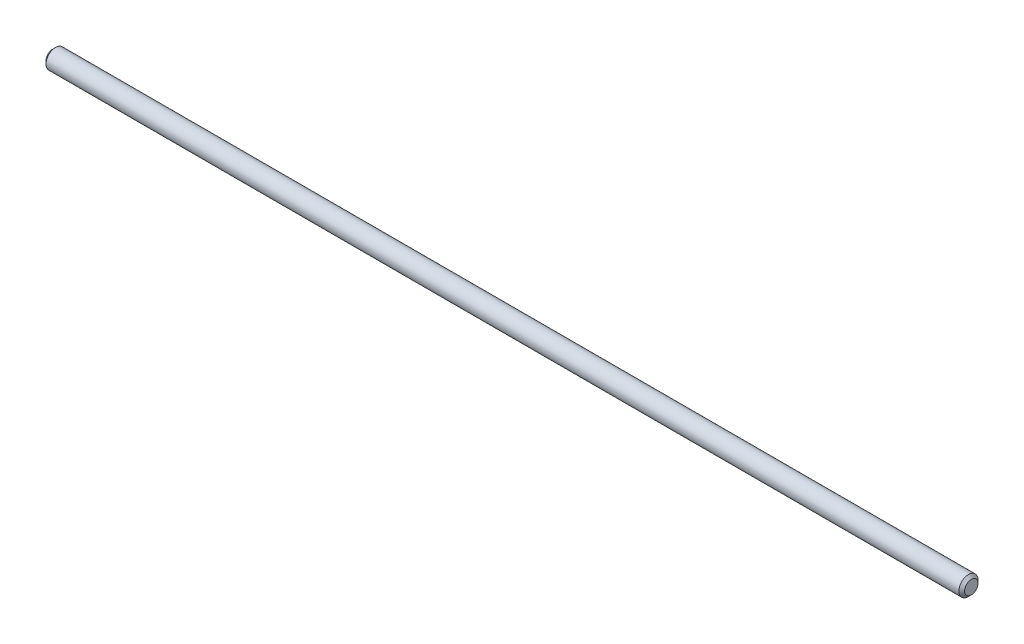
ISO-10303-21;
HEADER;
FILE_DESCRIPTION(('STEP AP214'),'2;1');
FILE_NAME('part.step','',(''),(''),'','','');
FILE_SCHEMA(('AUTOMOTIVE_DESIGN { 1 0 10303 214 1 1 1 1 }'));
ENDSEC;
DATA;
#1=APPLICATION_CONTEXT('core data for automotive mechanical design processes');
#2=APPLICATION_PROTOCOL_DEFINITION('international standard','automotive_design',2000,#1);
#3=PRODUCT_CONTEXT('',#1,'mechanical');
#4=PRODUCT('Part','Part','',(#3));
#5=PRODUCT_RELATED_PRODUCT_CATEGORY('part','',(#4));
#6=PRODUCT_DEFINITION_FORMATION('','',#4);
#7=PRODUCT_DEFINITION_CONTEXT('part definition',#1,'design');
#8=PRODUCT_DEFINITION('design','',#6,#7);
#9=PRODUCT_DEFINITION_SHAPE('','',#8);
#10=(LENGTH_UNIT() NAMED_UNIT(*) SI_UNIT(.MILLI.,.METRE.));
#11=(NAMED_UNIT(*) PLANE_ANGLE_UNIT() SI_UNIT($,.RADIAN.));
#12=(NAMED_UNIT(*) SI_UNIT($,.STERADIAN.) SOLID_ANGLE_UNIT());
#13=UNCERTAINTY_MEASURE_WITH_UNIT(LENGTH_MEASURE(1.E-05),#10,'distance_accuracy_value','');
#14=(GEOMETRIC_REPRESENTATION_CONTEXT(3) GLOBAL_UNCERTAINTY_ASSIGNED_CONTEXT((#13)) GLOBAL_UNIT_ASSIGNED_CONTEXT((#10,
#11,#12)) REPRESENTATION_CONTEXT('',''));
#15=CARTESIAN_POINT('',(0.,0.,0.));
#16=DIRECTION('',(0.,0.,1.));
#17=DIRECTION('',(1.,0.,0.));
#18=AXIS2_PLACEMENT_3D('',#15,#16,#17);
#19=CARTESIAN_POINT('',(-152.4,0.,0.));
#20=DIRECTION('',(1.,0.,0.));
#21=DIRECTION('',(0.,0.,-1.));
#22=AXIS2_PLACEMENT_3D('',#19,#20,#21);
#23=CYLINDRICAL_SURFACE('',#22,3.175);
#24=CARTESIAN_POINT('',(-151.4475,0.,0.));
#25=DIRECTION('',(1.,0.,0.));
#26=DIRECTION('',(0.,0.,-1.));
#27=AXIS2_PLACEMENT_3D('',#24,#25,#26);
#28=CIRCLE('',#27,3.175);
#29=CARTESIAN_POINT('',(-151.4475,0.,-3.175));
#30=VERTEX_POINT('',#29);
#31=EDGE_CURVE('E43',#30,#30,#28,.T.);
#32=ORIENTED_EDGE('',*,*,#31,.T.);
#33=EDGE_LOOP('',(#32));
#34=FACE_BOUND('',#33,.T.);
#35=CARTESIAN_POINT('',(151.4475,0.,0.));
#36=DIRECTION('',(1.,0.,0.));
#37=DIRECTION('',(0.,0.,-1.));
#38=AXIS2_PLACEMENT_3D('',#35,#36,#37);
#39=CIRCLE('',#38,3.175);
#40=CARTESIAN_POINT('',(151.4475,0.,-3.175));
#41=VERTEX_POINT('',#40);
#42=EDGE_CURVE('E47',#41,#41,#39,.F.);
#43=ORIENTED_EDGE('',*,*,#42,.T.);
#44=EDGE_LOOP('',(#43));
#45=FACE_BOUND('',#44,.T.);
#46=ADVANCED_FACE('F32',(#34,#45),#23,.T.);
#47=CARTESIAN_POINT('',(-152.4,0.,0.));
#48=DIRECTION('',(1.,0.,0.));
#49=DIRECTION('',(0.,0.,-1.));
#50=AXIS2_PLACEMENT_3D('',#47,#48,#49);
#51=PLANE('',#50);
#52=CARTESIAN_POINT('',(-152.4,0.,0.));
#53=DIRECTION('',(1.,0.,0.));
#54=DIRECTION('',(0.,0.,-1.));
#55=AXIS2_PLACEMENT_3D('',#52,#53,#54);
#56=CIRCLE('',#55,2.22249999999974);
#57=CARTESIAN_POINT('',(-152.4,0.,-2.22249999999974));
#58=VERTEX_POINT('',#57);
#59=EDGE_CURVE('E39',#58,#58,#56,.F.);
#60=ORIENTED_EDGE('',*,*,#59,.T.);
#61=EDGE_LOOP('',(#60));
#62=FACE_BOUND('',#61,.T.);
#63=ADVANCED_FACE('F63',(#62),#51,.F.);
#64=CARTESIAN_POINT('',(152.4,0.,0.));
#65=DIRECTION('',(1.,0.,0.));
#66=DIRECTION('',(0.,0.,-1.));
#67=AXIS2_PLACEMENT_3D('',#64,#65,#66);
#68=PLANE('',#67);
#69=CARTESIAN_POINT('',(152.4,0.,0.));
#70=DIRECTION('',(1.,0.,0.));
#71=DIRECTION('',(0.,0.,-1.));
#72=AXIS2_PLACEMENT_3D('',#69,#70,#71);
#73=CIRCLE('',#72,2.22249999999996);
#74=CARTESIAN_POINT('',(152.4,0.,-2.22249999999996));
#75=VERTEX_POINT('',#74);
#76=EDGE_CURVE('E10',#75,#75,#73,.T.);
#77=ORIENTED_EDGE('',*,*,#76,.T.);
#78=EDGE_LOOP('',(#77));
#79=FACE_BOUND('',#78,.T.);
#80=ADVANCED_FACE('F60',(#79),#68,.T.);
#81=CARTESIAN_POINT('',(-151.4475,0.,0.));
#82=DIRECTION('',(1.,0.,0.));
#83=DIRECTION('',(0.,0.,-1.));
#84=AXIS2_PLACEMENT_3D('',#81,#82,#83);
#85=CONICAL_SURFACE('',#84,3.175,0.785398163397458);
#86=ORIENTED_EDGE('',*,*,#59,.F.);
#87=EDGE_LOOP('',(#86));
#88=FACE_BOUND('',#87,.T.);
#89=ORIENTED_EDGE('',*,*,#31,.F.);
#90=EDGE_LOOP('',(#89));
#91=FACE_BOUND('',#90,.T.);
#92=ADVANCED_FACE('F56',(#88,#91),#85,.T.);
#93=CARTESIAN_POINT('',(152.4,0.,0.));
#94=DIRECTION('',(-1.,0.,0.));
#95=DIRECTION('',(0.,0.,1.));
#96=AXIS2_PLACEMENT_3D('',#93,#94,#95);
#97=CONICAL_SURFACE('',#96,2.22249999999996,0.785398163397487);
#98=ORIENTED_EDGE('',*,*,#42,.F.);
#99=EDGE_LOOP('',(#98));
#100=FACE_BOUND('',#99,.T.);
#101=ORIENTED_EDGE('',*,*,#76,.F.);
#102=EDGE_LOOP('',(#101));
#103=FACE_BOUND('',#102,.T.);
#104=ADVANCED_FACE('F34',(#100,#103),#97,.T.);
#105=CLOSED_SHELL('',(#46,#63,#80,#92,#104));
#106=MANIFOLD_SOLID_BREP('B2',#105);
#107=ADVANCED_BREP_SHAPE_REPRESENTATION('',(#18,#106),#14);
#108=SHAPE_DEFINITION_REPRESENTATION(#9,#107);
ENDSEC;
END-ISO-10303-21;
